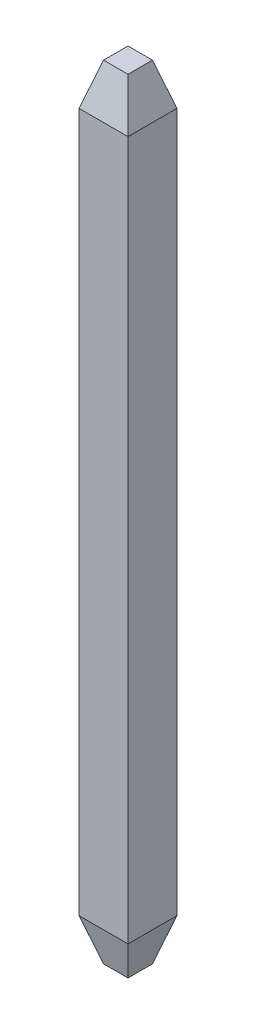
ISO-10303-21;
HEADER;
FILE_DESCRIPTION(('STEP AP214'),'2;1');
FILE_NAME('part.step','',(''),(''),'','','');
FILE_SCHEMA(('AUTOMOTIVE_DESIGN { 1 0 10303 214 1 1 1 1 }'));
ENDSEC;
DATA;
#1=APPLICATION_CONTEXT('core data for automotive mechanical design processes');
#2=APPLICATION_PROTOCOL_DEFINITION('international standard','automotive_design',2000,#1);
#3=PRODUCT_CONTEXT('',#1,'mechanical');
#4=PRODUCT('Part','Part','',(#3));
#5=PRODUCT_RELATED_PRODUCT_CATEGORY('part','',(#4));
#6=PRODUCT_DEFINITION_FORMATION('','',#4);
#7=PRODUCT_DEFINITION_CONTEXT('part definition',#1,'design');
#8=PRODUCT_DEFINITION('design','',#6,#7);
#9=PRODUCT_DEFINITION_SHAPE('','',#8);
#10=(LENGTH_UNIT() NAMED_UNIT(*) SI_UNIT(.MILLI.,.METRE.));
#11=(NAMED_UNIT(*) PLANE_ANGLE_UNIT() SI_UNIT($,.RADIAN.));
#12=(NAMED_UNIT(*) SI_UNIT($,.STERADIAN.) SOLID_ANGLE_UNIT());
#13=UNCERTAINTY_MEASURE_WITH_UNIT(LENGTH_MEASURE(1.E-05),#10,'distance_accuracy_value','');
#14=(GEOMETRIC_REPRESENTATION_CONTEXT(3) GLOBAL_UNCERTAINTY_ASSIGNED_CONTEXT((#13)) GLOBAL_UNIT_ASSIGNED_CONTEXT((#10,
#11,#12)) REPRESENTATION_CONTEXT('',''));
#15=CARTESIAN_POINT('',(0.,0.,0.));
#16=DIRECTION('',(0.,0.,1.));
#17=DIRECTION('',(1.,0.,0.));
#18=AXIS2_PLACEMENT_3D('',#15,#16,#17);
#19=CARTESIAN_POINT('',(9.37000000001295,-10.1039999999831,-19.5199999999763));
#20=DIRECTION('',(0.959644900900968,-0.281214622974644,0.));
#21=DIRECTION('',(0.,0.,-1.));
#22=AXIS2_PLACEMENT_3D('',#19,#20,#21);
#23=PLANE('',#22);
#24=DIRECTION('',(0.,0.,1.));
#25=VECTOR('',#24,1.);
#26=CARTESIAN_POINT('',(9.37000000001295,-10.1039999999831,-19.8399999999763));
#27=LINE('',#26,#25);
#28=CARTESIAN_POINT('',(9.37000000001292,-10.1039999999831,-19.8399999999763));
#29=VERTEX_POINT('',#28);
#30=CARTESIAN_POINT('',(9.37000000001292,-10.1039999999831,-19.1999999999763));
#31=VERTEX_POINT('',#30);
#32=EDGE_CURVE('E11',#29,#31,#27,.T.);
#33=ORIENTED_EDGE('',*,*,#32,.T.);
#34=DIRECTION('',(-0.270714017147728,-0.923811583516617,-0.270714017147728));
#35=VECTOR('',#34,1.);
#36=CARTESIAN_POINT('',(9.37000000001295,-10.1039999999831,-19.1999999999763));
#37=LINE('',#36,#35);
#38=CARTESIAN_POINT('',(9.21000000001293,-10.6499999999831,-19.3599999999763));
#39=VERTEX_POINT('',#38);
#40=EDGE_CURVE('E28',#31,#39,#37,.T.);
#41=ORIENTED_EDGE('',*,*,#40,.T.);
#42=DIRECTION('',(0.,0.,1.));
#43=VECTOR('',#42,1.);
#44=CARTESIAN_POINT('',(9.21000000001295,-10.6499999999831,-19.6799999999763));
#45=LINE('',#44,#43);
#46=CARTESIAN_POINT('',(9.21000000001293,-10.6499999999831,-19.6799999999763));
#47=VERTEX_POINT('',#46);
#48=EDGE_CURVE('E175',#47,#39,#45,.T.);
#49=ORIENTED_EDGE('',*,*,#48,.F.);
#50=DIRECTION('',(-0.270714017147728,-0.923811583516617,0.270714017147728));
#51=VECTOR('',#50,1.);
#52=CARTESIAN_POINT('',(9.37000000001295,-10.1039999999831,-19.8399999999763));
#53=LINE('',#52,#51);
#54=EDGE_CURVE('E178',#29,#47,#53,.T.);
#55=ORIENTED_EDGE('',*,*,#54,.F.);
#56=EDGE_LOOP('',(#33,#41,#49,#55));
#57=FACE_BOUND('',#56,.T.);
#58=ADVANCED_FACE('F17',(#57),#23,.T.);
#59=CARTESIAN_POINT('',(9.37000000001295,-11.0738701069126,-19.5199999999763));
#60=DIRECTION('',(1.,0.,0.));
#61=DIRECTION('',(0.,1.,0.));
#62=AXIS2_PLACEMENT_3D('',#59,#60,#61);
#63=PLANE('',#62);
#64=DIRECTION('',(0.,1.,0.));
#65=VECTOR('',#64,1.);
#66=CARTESIAN_POINT('',(9.37000000001295,-10.1039999999831,-19.1999999999763));
#67=LINE('',#66,#65);
#68=CARTESIAN_POINT('',(9.37000000001292,-0.965870106912631,-19.1999999999763));
#69=VERTEX_POINT('',#68);
#70=EDGE_CURVE('E42',#31,#69,#67,.T.);
#71=ORIENTED_EDGE('',*,*,#70,.F.);
#72=ORIENTED_EDGE('',*,*,#32,.F.);
#73=DIRECTION('',(0.,1.,0.));
#74=VECTOR('',#73,1.);
#75=CARTESIAN_POINT('',(9.37000000001295,-10.1039999999831,-19.8399999999763));
#76=LINE('',#75,#74);
#77=CARTESIAN_POINT('',(9.37000000001292,-0.965870106912631,-19.8399999999763));
#78=VERTEX_POINT('',#77);
#79=EDGE_CURVE('E151',#29,#78,#76,.T.);
#80=ORIENTED_EDGE('',*,*,#79,.T.);
#81=DIRECTION('',(0.,0.,1.));
#82=VECTOR('',#81,1.);
#83=CARTESIAN_POINT('',(9.37000000001295,-0.965870106912629,-19.8399999999763));
#84=LINE('',#83,#82);
#85=EDGE_CURVE('E145',#78,#69,#84,.T.);
#86=ORIENTED_EDGE('',*,*,#85,.T.);
#87=EDGE_LOOP('',(#71,#72,#80,#86));
#88=FACE_BOUND('',#87,.T.);
#89=ADVANCED_FACE('F149',(#88),#63,.T.);
#90=CARTESIAN_POINT('',(8.72900000001296,-5.53543505344787,-19.1999999999763));
#91=DIRECTION('',(0.,0.,1.));
#92=DIRECTION('',(1.,0.,0.));
#93=AXIS2_PLACEMENT_3D('',#90,#91,#92);
#94=PLANE('',#93);
#95=DIRECTION('',(0.,1.,0.));
#96=VECTOR('',#95,1.);
#97=CARTESIAN_POINT('',(8.73000000001294,-10.1039999999831,-19.1999999999763));
#98=LINE('',#97,#96);
#99=CARTESIAN_POINT('',(8.73000000001294,-10.1039999999831,-19.1999999999763));
#100=VERTEX_POINT('',#99);
#101=CARTESIAN_POINT('',(8.73000000001294,-0.965870106912631,-19.1999999999763));
#102=VERTEX_POINT('',#101);
#103=EDGE_CURVE('E21',#100,#102,#98,.T.);
#104=ORIENTED_EDGE('',*,*,#103,.F.);
#105=DIRECTION('',(-1.,0.,0.));
#106=VECTOR('',#105,1.);
#107=CARTESIAN_POINT('',(9.37000000001295,-10.1039999999831,-19.1999999999763));
#108=LINE('',#107,#106);
#109=EDGE_CURVE('E124',#31,#100,#108,.T.);
#110=ORIENTED_EDGE('',*,*,#109,.F.);
#111=ORIENTED_EDGE('',*,*,#70,.T.);
#112=DIRECTION('',(-1.,0.,0.));
#113=VECTOR('',#112,1.);
#114=CARTESIAN_POINT('',(9.37000000001295,-0.965870106912629,-19.1999999999763));
#115=LINE('',#114,#113);
#116=EDGE_CURVE('E133',#69,#102,#115,.T.);
#117=ORIENTED_EDGE('',*,*,#116,.T.);
#118=EDGE_LOOP('',(#104,#110,#111,#117));
#119=FACE_BOUND('',#118,.T.);
#120=ADVANCED_FACE('F143',(#119),#94,.T.);
#121=CARTESIAN_POINT('',(8.73000000001294,-5.53543505344786,-19.1989999999763));
#122=DIRECTION('',(-1.,0.,0.));
#123=DIRECTION('',(0.,0.,1.));
#124=AXIS2_PLACEMENT_3D('',#121,#122,#123);
#125=PLANE('',#124);
#126=DIRECTION('',(0.,1.,0.));
#127=VECTOR('',#126,1.);
#128=CARTESIAN_POINT('',(8.73000000001294,-10.1039999999831,-19.8399999999763));
#129=LINE('',#128,#127);
#130=CARTESIAN_POINT('',(8.73000000001294,-10.1039999999831,-19.8399999999763));
#131=VERTEX_POINT('',#130);
#132=CARTESIAN_POINT('',(8.73000000001294,-0.965870106912631,-19.8399999999763));
#133=VERTEX_POINT('',#132);
#134=EDGE_CURVE('E223',#131,#133,#129,.T.);
#135=ORIENTED_EDGE('',*,*,#134,.F.);
#136=DIRECTION('',(0.,0.,-1.));
#137=VECTOR('',#136,1.);
#138=CARTESIAN_POINT('',(8.73000000001294,-10.1039999999831,-19.1999999999763));
#139=LINE('',#138,#137);
#140=EDGE_CURVE('E168',#100,#131,#139,.T.);
#141=ORIENTED_EDGE('',*,*,#140,.F.);
#142=ORIENTED_EDGE('',*,*,#103,.T.);
#143=DIRECTION('',(0.,0.,-1.));
#144=VECTOR('',#143,1.);
#145=CARTESIAN_POINT('',(8.73000000001294,-0.965870106912629,-19.1999999999763));
#146=LINE('',#145,#144);
#147=EDGE_CURVE('E184',#102,#133,#146,.T.);
#148=ORIENTED_EDGE('',*,*,#147,.T.);
#149=EDGE_LOOP('',(#135,#141,#142,#148));
#150=FACE_BOUND('',#149,.T.);
#151=ADVANCED_FACE('F258',(#150),#125,.T.);
#152=CARTESIAN_POINT('',(8.73000000001294,-0.965870106912629,-19.5199999999763));
#153=DIRECTION('',(-0.959644900900973,0.281214622974629,0.));
#154=DIRECTION('',(0.,0.,1.));
#155=AXIS2_PLACEMENT_3D('',#152,#153,#154);
#156=PLANE('',#155);
#157=DIRECTION('',(0.270714017147713,0.923811583516621,-0.270714017147728));
#158=VECTOR('',#157,1.);
#159=CARTESIAN_POINT('',(8.73000000001294,-0.965870106912629,-19.1999999999763));
#160=LINE('',#159,#158);
#161=CARTESIAN_POINT('',(8.89000000001293,-0.419870106912631,-19.3599999999763));
#162=VERTEX_POINT('',#161);
#163=EDGE_CURVE('E138',#102,#162,#160,.T.);
#164=ORIENTED_EDGE('',*,*,#163,.T.);
#165=DIRECTION('',(0.,0.,-1.));
#166=VECTOR('',#165,1.);
#167=CARTESIAN_POINT('',(8.89000000001293,-0.419870106912629,-19.3599999999763));
#168=LINE('',#167,#166);
#169=CARTESIAN_POINT('',(8.89000000001293,-0.419870106912631,-19.6799999999763));
#170=VERTEX_POINT('',#169);
#171=EDGE_CURVE('E60',#162,#170,#168,.T.);
#172=ORIENTED_EDGE('',*,*,#171,.T.);
#173=DIRECTION('',(0.270714017147713,0.923811583516621,0.270714017147728));
#174=VECTOR('',#173,1.);
#175=CARTESIAN_POINT('',(8.73000000001294,-0.965870106912629,-19.8399999999763));
#176=LINE('',#175,#174);
#177=EDGE_CURVE('E76',#133,#170,#176,.T.);
#178=ORIENTED_EDGE('',*,*,#177,.F.);
#179=ORIENTED_EDGE('',*,*,#147,.F.);
#180=EDGE_LOOP('',(#164,#172,#178,#179));
#181=FACE_BOUND('',#180,.T.);
#182=ADVANCED_FACE('F255',(#181),#156,.T.);
#183=CARTESIAN_POINT('',(9.05000000001295,-0.965870106912629,-19.8399999999763));
#184=DIRECTION('',(0.,0.281214622974643,-0.959644900900968));
#185=DIRECTION('',(-1.,0.,0.));
#186=AXIS2_PLACEMENT_3D('',#183,#184,#185);
#187=PLANE('',#186);
#188=ORIENTED_EDGE('',*,*,#177,.T.);
#189=DIRECTION('',(1.,0.,0.));
#190=VECTOR('',#189,1.);
#191=CARTESIAN_POINT('',(8.89000000001293,-0.419870106912629,-19.6799999999763));
#192=LINE('',#191,#190);
#193=CARTESIAN_POINT('',(9.21000000001293,-0.419870106912631,-19.6799999999763));
#194=VERTEX_POINT('',#193);
#195=EDGE_CURVE('E201',#170,#194,#192,.T.);
#196=ORIENTED_EDGE('',*,*,#195,.T.);
#197=DIRECTION('',(-0.270714017147727,0.923811583516618,0.270714017147727));
#198=VECTOR('',#197,1.);
#199=CARTESIAN_POINT('',(9.37000000001295,-0.965870106912629,-19.8399999999763));
#200=LINE('',#199,#198);
#201=EDGE_CURVE('E170',#78,#194,#200,.T.);
#202=ORIENTED_EDGE('',*,*,#201,.F.);
#203=DIRECTION('',(1.,0.,0.));
#204=VECTOR('',#203,1.);
#205=CARTESIAN_POINT('',(8.73000000001294,-0.965870106912629,-19.8399999999763));
#206=LINE('',#205,#204);
#207=EDGE_CURVE('E209',#133,#78,#206,.T.);
#208=ORIENTED_EDGE('',*,*,#207,.F.);
#209=EDGE_LOOP('',(#188,#196,#202,#208));
#210=FACE_BOUND('',#209,.T.);
#211=ADVANCED_FACE('F251',(#210),#187,.T.);
#212=CARTESIAN_POINT('',(9.05000000001295,-0.419870106912629,-19.6809999999763));
#213=DIRECTION('',(0.,1.,0.));
#214=DIRECTION('',(1.,0.,0.));
#215=AXIS2_PLACEMENT_3D('',#212,#213,#214);
#216=PLANE('',#215);
#217=ORIENTED_EDGE('',*,*,#195,.F.);
#218=ORIENTED_EDGE('',*,*,#171,.F.);
#219=DIRECTION('',(-1.,0.,0.));
#220=VECTOR('',#219,1.);
#221=CARTESIAN_POINT('',(9.21000000001295,-0.419870106912629,-19.3599999999763));
#222=LINE('',#221,#220);
#223=CARTESIAN_POINT('',(9.21000000001293,-0.419870106912631,-19.3599999999763));
#224=VERTEX_POINT('',#223);
#225=EDGE_CURVE('E161',#224,#162,#222,.T.);
#226=ORIENTED_EDGE('',*,*,#225,.F.);
#227=DIRECTION('',(0.,0.,1.));
#228=VECTOR('',#227,1.);
#229=CARTESIAN_POINT('',(9.21000000001295,-0.419870106912629,-19.6799999999763));
#230=LINE('',#229,#228);
#231=EDGE_CURVE('E158',#194,#224,#230,.T.);
#232=ORIENTED_EDGE('',*,*,#231,.F.);
#233=EDGE_LOOP('',(#217,#218,#226,#232));
#234=FACE_BOUND('',#233,.T.);
#235=ADVANCED_FACE('F254',(#234),#216,.T.);
#236=CARTESIAN_POINT('',(8.73000000001294,-10.1039999999831,-19.5199999999763));
#237=DIRECTION('',(-0.959644900900972,-0.28121462297463,0.));
#238=DIRECTION('',(-0.28121462297463,0.959644900900972,0.));
#239=AXIS2_PLACEMENT_3D('',#236,#237,#238);
#240=PLANE('',#239);
#241=ORIENTED_EDGE('',*,*,#140,.T.);
#242=DIRECTION('',(0.270714017147714,-0.923811583516621,0.270714017147729));
#243=VECTOR('',#242,1.);
#244=CARTESIAN_POINT('',(8.73000000001294,-10.1039999999831,-19.8399999999763));
#245=LINE('',#244,#243);
#246=CARTESIAN_POINT('',(8.89000000001293,-10.6499999999831,-19.6799999999763));
#247=VERTEX_POINT('',#246);
#248=EDGE_CURVE('E160',#131,#247,#245,.T.);
#249=ORIENTED_EDGE('',*,*,#248,.T.);
#250=DIRECTION('',(0.,0.,-1.));
#251=VECTOR('',#250,1.);
#252=CARTESIAN_POINT('',(8.89000000001293,-10.6499999999831,-19.3599999999763));
#253=LINE('',#252,#251);
#254=CARTESIAN_POINT('',(8.89000000001293,-10.6499999999831,-19.3599999999763));
#255=VERTEX_POINT('',#254);
#256=EDGE_CURVE('E92',#255,#247,#253,.T.);
#257=ORIENTED_EDGE('',*,*,#256,.F.);
#258=DIRECTION('',(0.270714017147714,-0.923811583516621,-0.270714017147729));
#259=VECTOR('',#258,1.);
#260=CARTESIAN_POINT('',(8.73000000001294,-10.1039999999831,-19.1999999999763));
#261=LINE('',#260,#259);
#262=EDGE_CURVE('E104',#100,#255,#261,.T.);
#263=ORIENTED_EDGE('',*,*,#262,.F.);
#264=EDGE_LOOP('',(#241,#249,#257,#263));
#265=FACE_BOUND('',#264,.T.);
#266=ADVANCED_FACE('F217',(#265),#240,.T.);
#267=CARTESIAN_POINT('',(9.05000000001295,-0.965870106912629,-19.1999999999763));
#268=DIRECTION('',(0.,0.281214622974643,0.959644900900968));
#269=DIRECTION('',(1.,0.,0.));
#270=AXIS2_PLACEMENT_3D('',#267,#268,#269);
#271=PLANE('',#270);
#272=DIRECTION('',(-0.270714017147727,0.923811583516618,-0.270714017147727));
#273=VECTOR('',#272,1.);
#274=CARTESIAN_POINT('',(9.37000000001295,-0.965870106912629,-19.1999999999763));
#275=LINE('',#274,#273);
#276=EDGE_CURVE('E137',#69,#224,#275,.T.);
#277=ORIENTED_EDGE('',*,*,#276,.T.);
#278=ORIENTED_EDGE('',*,*,#225,.T.);
#279=ORIENTED_EDGE('',*,*,#163,.F.);
#280=ORIENTED_EDGE('',*,*,#116,.F.);
#281=EDGE_LOOP('',(#277,#278,#279,#280));
#282=FACE_BOUND('',#281,.T.);
#283=ADVANCED_FACE('F134',(#282),#271,.T.);
#284=CARTESIAN_POINT('',(9.37000000001295,-0.965870106912629,-19.5199999999763));
#285=DIRECTION('',(0.959644900900968,0.281214622974643,0.));
#286=DIRECTION('',(0.,0.,-1.));
#287=AXIS2_PLACEMENT_3D('',#284,#285,#286);
#288=PLANE('',#287);
#289=ORIENTED_EDGE('',*,*,#201,.T.);
#290=ORIENTED_EDGE('',*,*,#231,.T.);
#291=ORIENTED_EDGE('',*,*,#276,.F.);
#292=ORIENTED_EDGE('',*,*,#85,.F.);
#293=EDGE_LOOP('',(#289,#290,#291,#292));
#294=FACE_BOUND('',#293,.T.);
#295=ADVANCED_FACE('F156',(#294),#288,.T.);
#296=CARTESIAN_POINT('',(9.37100000001296,-5.53443505344787,-19.8399999999763));
#297=DIRECTION('',(0.,0.,-1.));
#298=DIRECTION('',(0.,-1.,0.));
#299=AXIS2_PLACEMENT_3D('',#296,#297,#298);
#300=PLANE('',#299);
#301=ORIENTED_EDGE('',*,*,#79,.F.);
#302=DIRECTION('',(1.,0.,0.));
#303=VECTOR('',#302,1.);
#304=CARTESIAN_POINT('',(8.73000000001294,-10.1039999999831,-19.8399999999763));
#305=LINE('',#304,#303);
#306=EDGE_CURVE('E200',#131,#29,#305,.T.);
#307=ORIENTED_EDGE('',*,*,#306,.F.);
#308=ORIENTED_EDGE('',*,*,#134,.T.);
#309=ORIENTED_EDGE('',*,*,#207,.T.);
#310=EDGE_LOOP('',(#301,#307,#308,#309));
#311=FACE_BOUND('',#310,.T.);
#312=ADVANCED_FACE('F19',(#311),#300,.T.);
#313=CARTESIAN_POINT('',(9.05000000001295,-10.1039999999831,-19.8399999999763));
#314=DIRECTION('',(0.,-0.281214622974644,-0.959644900900968));
#315=DIRECTION('',(0.,-0.959644900900968,0.281214622974644));
#316=AXIS2_PLACEMENT_3D('',#313,#314,#315);
#317=PLANE('',#316);
#318=ORIENTED_EDGE('',*,*,#306,.T.);
#319=ORIENTED_EDGE('',*,*,#54,.T.);
#320=DIRECTION('',(1.,0.,0.));
#321=VECTOR('',#320,1.);
#322=CARTESIAN_POINT('',(8.89000000001293,-10.6499999999831,-19.6799999999763));
#323=LINE('',#322,#321);
#324=EDGE_CURVE('E185',#247,#47,#323,.T.);
#325=ORIENTED_EDGE('',*,*,#324,.F.);
#326=ORIENTED_EDGE('',*,*,#248,.F.);
#327=EDGE_LOOP('',(#318,#319,#325,#326));
#328=FACE_BOUND('',#327,.T.);
#329=ADVANCED_FACE('F225',(#328),#317,.T.);
#330=CARTESIAN_POINT('',(8.88900000001296,-10.6499999999831,-19.5199999999763));
#331=DIRECTION('',(0.,-1.,0.));
#332=DIRECTION('',(0.,0.,-1.));
#333=AXIS2_PLACEMENT_3D('',#330,#331,#332);
#334=PLANE('',#333);
#335=ORIENTED_EDGE('',*,*,#48,.T.);
#336=DIRECTION('',(-1.,0.,0.));
#337=VECTOR('',#336,1.);
#338=CARTESIAN_POINT('',(9.21000000001295,-10.6499999999831,-19.3599999999763));
#339=LINE('',#338,#337);
#340=EDGE_CURVE('E179',#39,#255,#339,.T.);
#341=ORIENTED_EDGE('',*,*,#340,.T.);
#342=ORIENTED_EDGE('',*,*,#256,.T.);
#343=ORIENTED_EDGE('',*,*,#324,.T.);
#344=EDGE_LOOP('',(#335,#341,#342,#343));
#345=FACE_BOUND('',#344,.T.);
#346=ADVANCED_FACE('F226',(#345),#334,.T.);
#347=CARTESIAN_POINT('',(9.05000000001295,-10.1039999999831,-19.1999999999763));
#348=DIRECTION('',(0.,-0.281214622974644,0.959644900900968));
#349=DIRECTION('',(-1.,0.,0.));
#350=AXIS2_PLACEMENT_3D('',#347,#348,#349);
#351=PLANE('',#350);
#352=ORIENTED_EDGE('',*,*,#109,.T.);
#353=ORIENTED_EDGE('',*,*,#262,.T.);
#354=ORIENTED_EDGE('',*,*,#340,.F.);
#355=ORIENTED_EDGE('',*,*,#40,.F.);
#356=EDGE_LOOP('',(#352,#353,#354,#355));
#357=FACE_BOUND('',#356,.T.);
#358=ADVANCED_FACE('F233',(#357),#351,.T.);
#359=CLOSED_SHELL('',(#58,#89,#120,#151,#182,#211,#235,#266,#283,#295,#312,#329,#346,#358));
#360=MANIFOLD_SOLID_BREP('B1',#359);
#361=ADVANCED_BREP_SHAPE_REPRESENTATION('',(#18,#360),#14);
#362=SHAPE_DEFINITION_REPRESENTATION(#9,#361);
ENDSEC;
END-ISO-10303-21;
